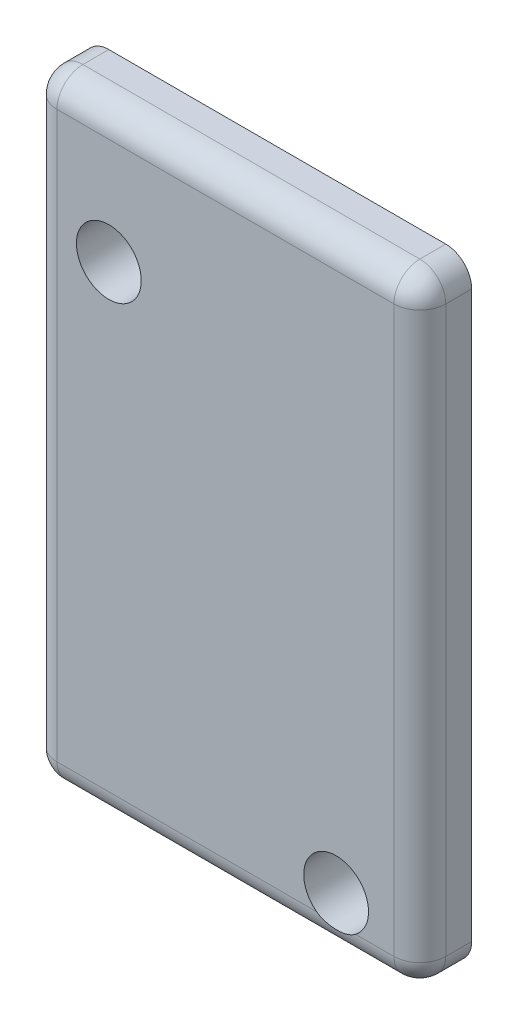
ISO-10303-21;
HEADER;
FILE_DESCRIPTION(('STEP AP214'),'2;1');
FILE_NAME('part.step','',(''),(''),'','','');
FILE_SCHEMA(('AUTOMOTIVE_DESIGN { 1 0 10303 214 1 1 1 1 }'));
ENDSEC;
DATA;
#1=APPLICATION_CONTEXT('core data for automotive mechanical design processes');
#2=APPLICATION_PROTOCOL_DEFINITION('international standard','automotive_design',2000,#1);
#3=PRODUCT_CONTEXT('',#1,'mechanical');
#4=PRODUCT('Part','Part','',(#3));
#5=PRODUCT_RELATED_PRODUCT_CATEGORY('part','',(#4));
#6=PRODUCT_DEFINITION_FORMATION('','',#4);
#7=PRODUCT_DEFINITION_CONTEXT('part definition',#1,'design');
#8=PRODUCT_DEFINITION('design','',#6,#7);
#9=PRODUCT_DEFINITION_SHAPE('','',#8);
#10=(LENGTH_UNIT() NAMED_UNIT(*) SI_UNIT(.MILLI.,.METRE.));
#11=(NAMED_UNIT(*) PLANE_ANGLE_UNIT() SI_UNIT($,.RADIAN.));
#12=(NAMED_UNIT(*) SI_UNIT($,.STERADIAN.) SOLID_ANGLE_UNIT());
#13=UNCERTAINTY_MEASURE_WITH_UNIT(LENGTH_MEASURE(1.E-05),#10,'distance_accuracy_value','');
#14=(GEOMETRIC_REPRESENTATION_CONTEXT(3) GLOBAL_UNCERTAINTY_ASSIGNED_CONTEXT((#13)) GLOBAL_UNIT_ASSIGNED_CONTEXT((#10,
#11,#12)) REPRESENTATION_CONTEXT('',''));
#15=CARTESIAN_POINT('',(0.,0.,0.));
#16=DIRECTION('',(0.,0.,1.));
#17=DIRECTION('',(1.,0.,0.));
#18=AXIS2_PLACEMENT_3D('',#15,#16,#17);
#19=CARTESIAN_POINT('',(0.,0.,2.));
#20=DIRECTION('',(0.,0.,-1.));
#21=DIRECTION('',(-1.,0.,0.));
#22=AXIS2_PLACEMENT_3D('',#19,#20,#21);
#23=PLANE('',#22);
#24=CARTESIAN_POINT('',(-3.23,-21.8,2.));
#25=DIRECTION('',(0.,0.,1.));
#26=DIRECTION('',(1.,0.,0.));
#27=AXIS2_PLACEMENT_3D('',#24,#25,#26);
#28=CIRCLE('',#27,1.25);
#29=CARTESIAN_POINT('',(-2.48,-22.8,2.));
#30=VERTEX_POINT('',#29);
#31=CARTESIAN_POINT('',(-3.98,-22.8,2.));
#32=VERTEX_POINT('',#31);
#33=EDGE_CURVE('E310',#30,#32,#28,.T.);
#34=ORIENTED_EDGE('',*,*,#33,.F.);
#35=DIRECTION('',(1.,0.,0.));
#36=VECTOR('',#35,1.);
#37=CARTESIAN_POINT('',(0.,-22.8,2.));
#38=LINE('',#37,#36);
#39=CARTESIAN_POINT('',(-0.999999999999997,-22.8,2.));
#40=VERTEX_POINT('',#39);
#41=EDGE_CURVE('E191',#30,#40,#38,.T.);
#42=ORIENTED_EDGE('',*,*,#41,.T.);
#43=DIRECTION('',(0.,1.,0.));
#44=VECTOR('',#43,1.);
#45=CARTESIAN_POINT('',(-1.,0.,2.));
#46=LINE('',#45,#44);
#47=CARTESIAN_POINT('',(-1.,-1.,2.));
#48=VERTEX_POINT('',#47);
#49=EDGE_CURVE('E189',#40,#48,#46,.T.);
#50=ORIENTED_EDGE('',*,*,#49,.T.);
#51=DIRECTION('',(-1.,0.,0.));
#52=VECTOR('',#51,1.);
#53=CARTESIAN_POINT('',(0.,-1.,2.));
#54=LINE('',#53,#52);
#55=CARTESIAN_POINT('',(-14.,-1.,2.));
#56=VERTEX_POINT('',#55);
#57=EDGE_CURVE('E186',#48,#56,#54,.T.);
#58=ORIENTED_EDGE('',*,*,#57,.T.);
#59=DIRECTION('',(0.,-1.,0.));
#60=VECTOR('',#59,1.);
#61=CARTESIAN_POINT('',(-14.,0.,2.));
#62=LINE('',#61,#60);
#63=CARTESIAN_POINT('',(-14.,-22.8,2.));
#64=VERTEX_POINT('',#63);
#65=EDGE_CURVE('E182',#56,#64,#62,.T.);
#66=ORIENTED_EDGE('',*,*,#65,.T.);
#67=DIRECTION('',(1.,0.,0.));
#68=VECTOR('',#67,1.);
#69=CARTESIAN_POINT('',(0.,-22.8,2.));
#70=LINE('',#69,#68);
#71=EDGE_CURVE('E184',#64,#32,#70,.T.);
#72=ORIENTED_EDGE('',*,*,#71,.T.);
#73=EDGE_LOOP('',(#34,#42,#50,#58,#66,#72));
#74=FACE_BOUND('',#73,.T.);
#75=CARTESIAN_POINT('',(-12.,-5.1,2.));
#76=DIRECTION('',(0.,0.,1.));
#77=DIRECTION('',(1.,0.,0.));
#78=AXIS2_PLACEMENT_3D('',#75,#76,#77);
#79=CIRCLE('',#78,1.25);
#80=CARTESIAN_POINT('',(-10.75,-5.1,2.));
#81=VERTEX_POINT('',#80);
#82=EDGE_CURVE('E149',#81,#81,#79,.T.);
#83=ORIENTED_EDGE('',*,*,#82,.F.);
#84=EDGE_LOOP('',(#83));
#85=FACE_BOUND('',#84,.T.);
#86=ADVANCED_FACE('F35',(#74,#85),#23,.F.);
#87=CARTESIAN_POINT('',(0.,0.,0.));
#88=DIRECTION('',(0.,0.,-1.));
#89=DIRECTION('',(-1.,0.,0.));
#90=AXIS2_PLACEMENT_3D('',#87,#88,#89);
#91=PLANE('',#90);
#92=CARTESIAN_POINT('',(-12.,-5.1,0.));
#93=DIRECTION('',(0.,0.,1.));
#94=DIRECTION('',(1.,0.,0.));
#95=AXIS2_PLACEMENT_3D('',#92,#93,#94);
#96=CIRCLE('',#95,1.25);
#97=CARTESIAN_POINT('',(-10.75,-5.1,0.));
#98=VERTEX_POINT('',#97);
#99=EDGE_CURVE('E155',#98,#98,#96,.T.);
#100=ORIENTED_EDGE('',*,*,#99,.T.);
#101=EDGE_LOOP('',(#100));
#102=FACE_BOUND('',#101,.T.);
#103=DIRECTION('',(0.,1.,0.));
#104=VECTOR('',#103,1.);
#105=CARTESIAN_POINT('',(0.,0.,0.));
#106=LINE('',#105,#104);
#107=CARTESIAN_POINT('',(0.,-22.8,0.));
#108=VERTEX_POINT('',#107);
#109=CARTESIAN_POINT('',(0.,-1.,0.));
#110=VERTEX_POINT('',#109);
#111=EDGE_CURVE('E125',#108,#110,#106,.T.);
#112=ORIENTED_EDGE('',*,*,#111,.F.);
#113=CARTESIAN_POINT('',(-0.999999999999997,-22.8,0.));
#114=DIRECTION('',(0.,0.,-1.));
#115=DIRECTION('',(-1.,0.,0.));
#116=AXIS2_PLACEMENT_3D('',#113,#114,#115);
#117=CIRCLE('',#116,1.);
#118=CARTESIAN_POINT('',(-0.999999999999997,-23.8,0.));
#119=VERTEX_POINT('',#118);
#120=EDGE_CURVE('E135',#108,#119,#117,.T.);
#121=ORIENTED_EDGE('',*,*,#120,.T.);
#122=DIRECTION('',(1.,0.,0.));
#123=VECTOR('',#122,1.);
#124=CARTESIAN_POINT('',(0.,-23.8,0.));
#125=LINE('',#124,#123);
#126=CARTESIAN_POINT('',(-14.,-23.8,0.));
#127=VERTEX_POINT('',#126);
#128=EDGE_CURVE('E161',#127,#119,#125,.T.);
#129=ORIENTED_EDGE('',*,*,#128,.F.);
#130=CARTESIAN_POINT('',(-14.,-22.8,0.));
#131=DIRECTION('',(0.,0.,-1.));
#132=DIRECTION('',(-1.,0.,0.));
#133=AXIS2_PLACEMENT_3D('',#130,#131,#132);
#134=CIRCLE('',#133,1.);
#135=CARTESIAN_POINT('',(-15.,-22.8,0.));
#136=VERTEX_POINT('',#135);
#137=EDGE_CURVE('E131',#127,#136,#134,.T.);
#138=ORIENTED_EDGE('',*,*,#137,.T.);
#139=DIRECTION('',(0.,-1.,0.));
#140=VECTOR('',#139,1.);
#141=CARTESIAN_POINT('',(-15.,0.,0.));
#142=LINE('',#141,#140);
#143=CARTESIAN_POINT('',(-15.,-1.,0.));
#144=VERTEX_POINT('',#143);
#145=EDGE_CURVE('E152',#144,#136,#142,.T.);
#146=ORIENTED_EDGE('',*,*,#145,.F.);
#147=CARTESIAN_POINT('',(-14.,-1.,0.));
#148=DIRECTION('',(0.,0.,-1.));
#149=DIRECTION('',(-1.,0.,0.));
#150=AXIS2_PLACEMENT_3D('',#147,#148,#149);
#151=CIRCLE('',#150,1.);
#152=CARTESIAN_POINT('',(-14.,0.,0.));
#153=VERTEX_POINT('',#152);
#154=EDGE_CURVE('E165',#144,#153,#151,.T.);
#155=ORIENTED_EDGE('',*,*,#154,.T.);
#156=DIRECTION('',(-1.,0.,0.));
#157=VECTOR('',#156,1.);
#158=CARTESIAN_POINT('',(0.,0.,0.));
#159=LINE('',#158,#157);
#160=CARTESIAN_POINT('',(-1.,0.,0.));
#161=VERTEX_POINT('',#160);
#162=EDGE_CURVE('E148',#161,#153,#159,.T.);
#163=ORIENTED_EDGE('',*,*,#162,.F.);
#164=CARTESIAN_POINT('',(-1.,-1.,0.));
#165=DIRECTION('',(0.,0.,-1.));
#166=DIRECTION('',(-1.,0.,0.));
#167=AXIS2_PLACEMENT_3D('',#164,#165,#166);
#168=CIRCLE('',#167,1.);
#169=EDGE_CURVE('E142',#161,#110,#168,.T.);
#170=ORIENTED_EDGE('',*,*,#169,.T.);
#171=EDGE_LOOP('',(#112,#121,#129,#138,#146,#155,#163,#170));
#172=FACE_BOUND('',#171,.T.);
#173=CARTESIAN_POINT('',(-3.23,-21.8,0.));
#174=DIRECTION('',(0.,0.,1.));
#175=DIRECTION('',(1.,0.,0.));
#176=AXIS2_PLACEMENT_3D('',#173,#174,#175);
#177=CIRCLE('',#176,1.25);
#178=CARTESIAN_POINT('',(-1.98,-21.8,0.));
#179=VERTEX_POINT('',#178);
#180=EDGE_CURVE('E307',#179,#179,#177,.T.);
#181=ORIENTED_EDGE('',*,*,#180,.T.);
#182=EDGE_LOOP('',(#181));
#183=FACE_BOUND('',#182,.T.);
#184=ADVANCED_FACE('F144',(#102,#172,#183),#91,.T.);
#185=CARTESIAN_POINT('',(0.,0.,2.));
#186=DIRECTION('',(-1.,0.,0.));
#187=DIRECTION('',(0.,-1.,0.));
#188=AXIS2_PLACEMENT_3D('',#185,#186,#187);
#189=PLANE('',#188);
#190=DIRECTION('',(0.,0.,-1.));
#191=VECTOR('',#190,1.);
#192=CARTESIAN_POINT('',(0.,-1.,2.));
#193=LINE('',#192,#191);
#194=CARTESIAN_POINT('',(0.,-1.,1.));
#195=VERTEX_POINT('',#194);
#196=EDGE_CURVE('E132',#110,#195,#193,.F.);
#197=ORIENTED_EDGE('',*,*,#196,.T.);
#198=DIRECTION('',(0.,1.,0.));
#199=VECTOR('',#198,1.);
#200=CARTESIAN_POINT('',(0.,0.,1.));
#201=LINE('',#200,#199);
#202=CARTESIAN_POINT('',(0.,-22.8,1.));
#203=VERTEX_POINT('',#202);
#204=EDGE_CURVE('E128',#195,#203,#201,.F.);
#205=ORIENTED_EDGE('',*,*,#204,.T.);
#206=DIRECTION('',(0.,0.,-1.));
#207=VECTOR('',#206,1.);
#208=CARTESIAN_POINT('',(0.,-22.8,2.));
#209=LINE('',#208,#207);
#210=EDGE_CURVE('E120',#203,#108,#209,.T.);
#211=ORIENTED_EDGE('',*,*,#210,.T.);
#212=ORIENTED_EDGE('',*,*,#111,.T.);
#213=EDGE_LOOP('',(#197,#205,#211,#212));
#214=FACE_BOUND('',#213,.T.);
#215=ADVANCED_FACE('F123',(#214),#189,.F.);
#216=CARTESIAN_POINT('',(0.,0.,2.));
#217=DIRECTION('',(0.,-1.,0.));
#218=DIRECTION('',(1.,0.,0.));
#219=AXIS2_PLACEMENT_3D('',#216,#217,#218);
#220=PLANE('',#219);
#221=DIRECTION('',(0.,0.,-1.));
#222=VECTOR('',#221,1.);
#223=CARTESIAN_POINT('',(-14.,0.,2.));
#224=LINE('',#223,#222);
#225=CARTESIAN_POINT('',(-14.,0.,1.));
#226=VERTEX_POINT('',#225);
#227=EDGE_CURVE('E170',#153,#226,#224,.F.);
#228=ORIENTED_EDGE('',*,*,#227,.T.);
#229=DIRECTION('',(-1.,0.,0.));
#230=VECTOR('',#229,1.);
#231=CARTESIAN_POINT('',(0.,0.,1.));
#232=LINE('',#231,#230);
#233=CARTESIAN_POINT('',(-1.,0.,1.));
#234=VERTEX_POINT('',#233);
#235=EDGE_CURVE('E193',#226,#234,#232,.F.);
#236=ORIENTED_EDGE('',*,*,#235,.T.);
#237=DIRECTION('',(0.,0.,-1.));
#238=VECTOR('',#237,1.);
#239=CARTESIAN_POINT('',(-1.,0.,2.));
#240=LINE('',#239,#238);
#241=EDGE_CURVE('E173',#234,#161,#240,.T.);
#242=ORIENTED_EDGE('',*,*,#241,.T.);
#243=ORIENTED_EDGE('',*,*,#162,.T.);
#244=EDGE_LOOP('',(#228,#236,#242,#243));
#245=FACE_BOUND('',#244,.T.);
#246=ADVANCED_FACE('F246',(#245),#220,.F.);
#247=CARTESIAN_POINT('',(-15.,0.,2.));
#248=DIRECTION('',(1.,0.,0.));
#249=DIRECTION('',(0.,1.,0.));
#250=AXIS2_PLACEMENT_3D('',#247,#248,#249);
#251=PLANE('',#250);
#252=DIRECTION('',(0.,0.,-1.));
#253=VECTOR('',#252,1.);
#254=CARTESIAN_POINT('',(-15.,-22.8,2.));
#255=LINE('',#254,#253);
#256=CARTESIAN_POINT('',(-15.,-22.8,1.));
#257=VERTEX_POINT('',#256);
#258=EDGE_CURVE('E175',#136,#257,#255,.F.);
#259=ORIENTED_EDGE('',*,*,#258,.T.);
#260=DIRECTION('',(0.,-1.,0.));
#261=VECTOR('',#260,1.);
#262=CARTESIAN_POINT('',(-15.,0.,1.));
#263=LINE('',#262,#261);
#264=CARTESIAN_POINT('',(-15.,-1.,1.));
#265=VERTEX_POINT('',#264);
#266=EDGE_CURVE('E11',#257,#265,#263,.F.);
#267=ORIENTED_EDGE('',*,*,#266,.T.);
#268=DIRECTION('',(0.,0.,-1.));
#269=VECTOR('',#268,1.);
#270=CARTESIAN_POINT('',(-15.,-1.,2.));
#271=LINE('',#270,#269);
#272=EDGE_CURVE('E177',#265,#144,#271,.T.);
#273=ORIENTED_EDGE('',*,*,#272,.T.);
#274=ORIENTED_EDGE('',*,*,#145,.T.);
#275=EDGE_LOOP('',(#259,#267,#273,#274));
#276=FACE_BOUND('',#275,.T.);
#277=ADVANCED_FACE('F243',(#276),#251,.F.);
#278=CARTESIAN_POINT('',(0.,-23.8,2.));
#279=DIRECTION('',(0.,1.,0.));
#280=DIRECTION('',(-1.,0.,0.));
#281=AXIS2_PLACEMENT_3D('',#278,#279,#280);
#282=PLANE('',#281);
#283=DIRECTION('',(0.,0.,-1.));
#284=VECTOR('',#283,1.);
#285=CARTESIAN_POINT('',(-0.999999999999997,-23.8,2.));
#286=LINE('',#285,#284);
#287=CARTESIAN_POINT('',(-0.999999999999997,-23.8,1.));
#288=VERTEX_POINT('',#287);
#289=EDGE_CURVE('E137',#119,#288,#286,.F.);
#290=ORIENTED_EDGE('',*,*,#289,.T.);
#291=DIRECTION('',(1.,0.,0.));
#292=VECTOR('',#291,1.);
#293=CARTESIAN_POINT('',(0.,-23.8,1.));
#294=LINE('',#293,#292);
#295=CARTESIAN_POINT('',(-14.,-23.8,1.));
#296=VERTEX_POINT('',#295);
#297=EDGE_CURVE('E59',#288,#296,#294,.F.);
#298=ORIENTED_EDGE('',*,*,#297,.T.);
#299=DIRECTION('',(0.,0.,-1.));
#300=VECTOR('',#299,1.);
#301=CARTESIAN_POINT('',(-14.,-23.8,2.));
#302=LINE('',#301,#300);
#303=EDGE_CURVE('E141',#296,#127,#302,.T.);
#304=ORIENTED_EDGE('',*,*,#303,.T.);
#305=ORIENTED_EDGE('',*,*,#128,.T.);
#306=EDGE_LOOP('',(#290,#298,#304,#305));
#307=FACE_BOUND('',#306,.T.);
#308=ADVANCED_FACE('F240',(#307),#282,.F.);
#309=CARTESIAN_POINT('',(-12.,-5.1,2.));
#310=DIRECTION('',(0.,0.,-1.));
#311=DIRECTION('',(-1.,0.,0.));
#312=AXIS2_PLACEMENT_3D('',#309,#310,#311);
#313=CYLINDRICAL_SURFACE('',#312,1.25);
#314=ORIENTED_EDGE('',*,*,#82,.T.);
#315=EDGE_LOOP('',(#314));
#316=FACE_BOUND('',#315,.T.);
#317=ORIENTED_EDGE('',*,*,#99,.F.);
#318=EDGE_LOOP('',(#317));
#319=FACE_BOUND('',#318,.T.);
#320=ADVANCED_FACE('F238',(#316,#319),#313,.F.);
#321=CARTESIAN_POINT('',(-3.23,-21.8,2.));
#322=DIRECTION('',(0.,0.,-1.));
#323=DIRECTION('',(-1.,0.,0.));
#324=AXIS2_PLACEMENT_3D('',#321,#322,#323);
#325=CYLINDRICAL_SURFACE('',#324,1.25);
#326=ORIENTED_EDGE('',*,*,#33,.T.);
#327=CARTESIAN_POINT('',(-3.98,-22.8,2.));
#328=CARTESIAN_POINT('',(-3.95216685685772,-22.8208754193321,1.99999586398987));
#329=CARTESIAN_POINT('',(-3.92348426480646,-22.8405703669081,1.99934713750413));
#330=CARTESIAN_POINT('',(-3.86461510059685,-22.8774834745816,1.99716564495891));
#331=CARTESIAN_POINT('',(-3.83442920727403,-22.8947027391947,1.99563327467206));
#332=CARTESIAN_POINT('',(-3.74187228885698,-22.9424987589817,1.99031685157286));
#333=CARTESIAN_POINT('',(-3.67750000394349,-22.9692152519311,1.98581342821781));
#334=CARTESIAN_POINT('',(-3.54521662549237,-23.0115962359521,1.97759753443509));
#335=CARTESIAN_POINT('',(-3.47730659565258,-23.0272640286875,1.97388482795055));
#336=CARTESIAN_POINT('',(-3.33979942824658,-23.0470995886788,1.96904572896955));
#337=CARTESIAN_POINT('',(-3.2702045782966,-23.0512821540531,1.96791600874414));
#338=CARTESIAN_POINT('',(-3.131763991366,-23.0480442615429,1.96874946257098));
#339=CARTESIAN_POINT('',(-3.06291632393299,-23.0406989272705,1.97069261234645));
#340=CARTESIAN_POINT('',(-2.92740921704492,-23.0147859358695,1.97675020659622));
#341=CARTESIAN_POINT('',(-2.86075205907436,-22.9962069461847,1.98086684316016));
#342=CARTESIAN_POINT('',(-2.73961844539446,-22.9513691806528,1.98870213819813));
#343=CARTESIAN_POINT('',(-2.68466906472272,-22.9263825472822,1.99240509140681));
#344=CARTESIAN_POINT('',(-2.60538473054195,-22.8831720756812,1.99663963335268));
#345=CARTESIAN_POINT('',(-2.57949092518132,-22.8678217449452,1.99783092485857));
#346=CARTESIAN_POINT('',(-2.52885063221708,-22.8352758407344,1.99951002933292));
#347=CARTESIAN_POINT('',(-2.50410468035409,-22.8180794177946,1.99999751694803));
#348=CARTESIAN_POINT('',(-2.48,-22.8,2.));
#349=B_SPLINE_CURVE_WITH_KNOTS('',3,(#327,#328,#329,#330,#331,#332,#333,#334,#335,#336,#337,
#338,#339,#340,#341,#342,#343,#344,#345,#346,#347,#348),.UNSPECIFIED.,.F.,.F.,(4,2,2,2,2,2,2,2,
2,2,4),(0.,0.104289480114312,0.20853228655772,0.41701042322792,0.625426234311087,
0.833573386174587,1.04036973220747,1.24737504408877,1.42813829489159,1.51843817129671,
1.60877977803547),.UNSPECIFIED.);
#350=EDGE_CURVE('E200',#32,#30,#349,.T.);
#351=ORIENTED_EDGE('',*,*,#350,.T.);
#352=EDGE_LOOP('',(#326,#351));
#353=FACE_BOUND('',#352,.T.);
#354=ORIENTED_EDGE('',*,*,#180,.F.);
#355=EDGE_LOOP('',(#354));
#356=FACE_BOUND('',#355,.T.);
#357=ADVANCED_FACE('F209',(#353,#356),#325,.F.);
#358=CARTESIAN_POINT('',(-0.999999999999997,-22.8,2.));
#359=DIRECTION('',(0.,0.,-1.));
#360=DIRECTION('',(-1.,0.,0.));
#361=AXIS2_PLACEMENT_3D('',#358,#359,#360);
#362=CYLINDRICAL_SURFACE('',#361,1.);
#363=ORIENTED_EDGE('',*,*,#210,.F.);
#364=CARTESIAN_POINT('',(-0.999999999999997,-22.8,1.));
#365=DIRECTION('',(0.,0.,-1.));
#366=DIRECTION('',(-1.,0.,0.));
#367=AXIS2_PLACEMENT_3D('',#364,#365,#366);
#368=CIRCLE('',#367,1.);
#369=EDGE_CURVE('E198',#203,#288,#368,.T.);
#370=ORIENTED_EDGE('',*,*,#369,.T.);
#371=ORIENTED_EDGE('',*,*,#289,.F.);
#372=ORIENTED_EDGE('',*,*,#120,.F.);
#373=EDGE_LOOP('',(#363,#370,#371,#372));
#374=FACE_BOUND('',#373,.T.);
#375=ADVANCED_FACE('F136',(#374),#362,.T.);
#376=CARTESIAN_POINT('',(-1.,-1.,2.));
#377=DIRECTION('',(0.,0.,-1.));
#378=DIRECTION('',(-1.,0.,0.));
#379=AXIS2_PLACEMENT_3D('',#376,#377,#378);
#380=CYLINDRICAL_SURFACE('',#379,1.);
#381=ORIENTED_EDGE('',*,*,#241,.F.);
#382=CARTESIAN_POINT('',(-1.,-1.,1.));
#383=DIRECTION('',(0.,0.,-1.));
#384=DIRECTION('',(-1.,0.,0.));
#385=AXIS2_PLACEMENT_3D('',#382,#383,#384);
#386=CIRCLE('',#385,1.);
#387=EDGE_CURVE('E195',#234,#195,#386,.T.);
#388=ORIENTED_EDGE('',*,*,#387,.T.);
#389=ORIENTED_EDGE('',*,*,#196,.F.);
#390=ORIENTED_EDGE('',*,*,#169,.F.);
#391=EDGE_LOOP('',(#381,#388,#389,#390));
#392=FACE_BOUND('',#391,.T.);
#393=ADVANCED_FACE('F255',(#392),#380,.T.);
#394=CARTESIAN_POINT('',(-14.,-1.,2.));
#395=DIRECTION('',(0.,0.,-1.));
#396=DIRECTION('',(-1.,0.,0.));
#397=AXIS2_PLACEMENT_3D('',#394,#395,#396);
#398=CYLINDRICAL_SURFACE('',#397,1.);
#399=ORIENTED_EDGE('',*,*,#272,.F.);
#400=CARTESIAN_POINT('',(-14.,-1.,1.));
#401=DIRECTION('',(0.,0.,-1.));
#402=DIRECTION('',(-1.,0.,0.));
#403=AXIS2_PLACEMENT_3D('',#400,#401,#402);
#404=CIRCLE('',#403,1.);
#405=EDGE_CURVE('E179',#265,#226,#404,.T.);
#406=ORIENTED_EDGE('',*,*,#405,.T.);
#407=ORIENTED_EDGE('',*,*,#227,.F.);
#408=ORIENTED_EDGE('',*,*,#154,.F.);
#409=EDGE_LOOP('',(#399,#406,#407,#408));
#410=FACE_BOUND('',#409,.T.);
#411=ADVANCED_FACE('F258',(#410),#398,.T.);
#412=CARTESIAN_POINT('',(-14.,-22.8,2.));
#413=DIRECTION('',(0.,0.,-1.));
#414=DIRECTION('',(-1.,0.,0.));
#415=AXIS2_PLACEMENT_3D('',#412,#413,#414);
#416=CYLINDRICAL_SURFACE('',#415,1.);
#417=ORIENTED_EDGE('',*,*,#303,.F.);
#418=CARTESIAN_POINT('',(-14.,-22.8,1.));
#419=DIRECTION('',(0.,0.,-1.));
#420=DIRECTION('',(-1.,0.,0.));
#421=AXIS2_PLACEMENT_3D('',#418,#419,#420);
#422=CIRCLE('',#421,1.);
#423=EDGE_CURVE('E44',#296,#257,#422,.T.);
#424=ORIENTED_EDGE('',*,*,#423,.T.);
#425=ORIENTED_EDGE('',*,*,#258,.F.);
#426=ORIENTED_EDGE('',*,*,#137,.F.);
#427=EDGE_LOOP('',(#417,#424,#425,#426));
#428=FACE_BOUND('',#427,.T.);
#429=ADVANCED_FACE('F225',(#428),#416,.T.);
#430=CARTESIAN_POINT('',(-0.999999999999997,-22.8,1.));
#431=DIRECTION('',(0.,0.,-1.));
#432=DIRECTION('',(-1.,0.,0.));
#433=AXIS2_PLACEMENT_3D('',#430,#431,#432);
#434=SPHERICAL_SURFACE('',#433,1.);
#435=CARTESIAN_POINT('',(-0.999999999999997,-22.8,1.));
#436=DIRECTION('',(-1.,0.,0.));
#437=DIRECTION('',(0.,-1.,0.));
#438=AXIS2_PLACEMENT_3D('',#435,#436,#437);
#439=CIRCLE('',#438,1.);
#440=EDGE_CURVE('E302',#288,#40,#439,.T.);
#441=ORIENTED_EDGE('',*,*,#440,.F.);
#442=ORIENTED_EDGE('',*,*,#369,.F.);
#443=CARTESIAN_POINT('',(-0.999999999999997,-22.8,1.));
#444=DIRECTION('',(0.,1.,0.));
#445=DIRECTION('',(0.,0.,1.));
#446=AXIS2_PLACEMENT_3D('',#443,#444,#445);
#447=CIRCLE('',#446,1.);
#448=EDGE_CURVE('E39',#40,#203,#447,.T.);
#449=ORIENTED_EDGE('',*,*,#448,.F.);
#450=EDGE_LOOP('',(#441,#442,#449));
#451=FACE_BOUND('',#450,.T.);
#452=ADVANCED_FACE('F37',(#451),#434,.T.);
#453=CARTESIAN_POINT('',(-1.,0.,1.));
#454=DIRECTION('',(0.,1.,0.));
#455=DIRECTION('',(-1.,0.,0.));
#456=AXIS2_PLACEMENT_3D('',#453,#454,#455);
#457=CYLINDRICAL_SURFACE('',#456,1.);
#458=ORIENTED_EDGE('',*,*,#448,.T.);
#459=ORIENTED_EDGE('',*,*,#204,.F.);
#460=CARTESIAN_POINT('',(-1.,-1.,1.));
#461=DIRECTION('',(0.,1.,0.));
#462=DIRECTION('',(-1.,0.,0.));
#463=AXIS2_PLACEMENT_3D('',#460,#461,#462);
#464=CIRCLE('',#463,1.);
#465=EDGE_CURVE('E300',#48,#195,#464,.T.);
#466=ORIENTED_EDGE('',*,*,#465,.F.);
#467=ORIENTED_EDGE('',*,*,#49,.F.);
#468=EDGE_LOOP('',(#458,#459,#466,#467));
#469=FACE_BOUND('',#468,.T.);
#470=ADVANCED_FACE('F217',(#469),#457,.T.);
#471=CARTESIAN_POINT('',(0.,-22.8,1.));
#472=DIRECTION('',(1.,0.,0.));
#473=DIRECTION('',(0.,1.,0.));
#474=AXIS2_PLACEMENT_3D('',#471,#472,#473);
#475=CYLINDRICAL_SURFACE('',#474,1.);
#476=ORIENTED_EDGE('',*,*,#350,.F.);
#477=ORIENTED_EDGE('',*,*,#71,.F.);
#478=CARTESIAN_POINT('',(-14.,-22.8,1.));
#479=DIRECTION('',(-1.,0.,0.));
#480=DIRECTION('',(0.,0.,1.));
#481=AXIS2_PLACEMENT_3D('',#478,#479,#480);
#482=CIRCLE('',#481,1.);
#483=EDGE_CURVE('E286',#296,#64,#482,.T.);
#484=ORIENTED_EDGE('',*,*,#483,.F.);
#485=ORIENTED_EDGE('',*,*,#297,.F.);
#486=ORIENTED_EDGE('',*,*,#440,.T.);
#487=ORIENTED_EDGE('',*,*,#41,.F.);
#488=EDGE_LOOP('',(#476,#477,#484,#485,#486,#487));
#489=FACE_BOUND('',#488,.T.);
#490=ADVANCED_FACE('F212',(#489),#475,.T.);
#491=CARTESIAN_POINT('',(-1.,-1.,1.));
#492=DIRECTION('',(0.,0.,-1.));
#493=DIRECTION('',(-1.,0.,0.));
#494=AXIS2_PLACEMENT_3D('',#491,#492,#493);
#495=SPHERICAL_SURFACE('',#494,1.);
#496=ORIENTED_EDGE('',*,*,#465,.T.);
#497=ORIENTED_EDGE('',*,*,#387,.F.);
#498=CARTESIAN_POINT('',(-1.,-1.,1.));
#499=DIRECTION('',(-1.,0.,0.));
#500=DIRECTION('',(0.,-1.,0.));
#501=AXIS2_PLACEMENT_3D('',#498,#499,#500);
#502=CIRCLE('',#501,1.);
#503=EDGE_CURVE('E296',#48,#234,#502,.T.);
#504=ORIENTED_EDGE('',*,*,#503,.F.);
#505=EDGE_LOOP('',(#496,#497,#504));
#506=FACE_BOUND('',#505,.T.);
#507=ADVANCED_FACE('F216',(#506),#495,.T.);
#508=CARTESIAN_POINT('',(-14.,-22.8,1.));
#509=DIRECTION('',(0.,0.,-1.));
#510=DIRECTION('',(-1.,0.,0.));
#511=AXIS2_PLACEMENT_3D('',#508,#509,#510);
#512=SPHERICAL_SURFACE('',#511,1.);
#513=ORIENTED_EDGE('',*,*,#423,.F.);
#514=ORIENTED_EDGE('',*,*,#483,.T.);
#515=CARTESIAN_POINT('',(-14.,-22.8,1.));
#516=DIRECTION('',(0.,1.,0.));
#517=DIRECTION('',(0.,0.,1.));
#518=AXIS2_PLACEMENT_3D('',#515,#516,#517);
#519=CIRCLE('',#518,1.);
#520=EDGE_CURVE('E288',#257,#64,#519,.T.);
#521=ORIENTED_EDGE('',*,*,#520,.F.);
#522=EDGE_LOOP('',(#513,#514,#521));
#523=FACE_BOUND('',#522,.T.);
#524=ADVANCED_FACE('F275',(#523),#512,.T.);
#525=CARTESIAN_POINT('',(0.,-1.,1.));
#526=DIRECTION('',(-1.,0.,0.));
#527=DIRECTION('',(0.,-1.,0.));
#528=AXIS2_PLACEMENT_3D('',#525,#526,#527);
#529=CYLINDRICAL_SURFACE('',#528,1.);
#530=ORIENTED_EDGE('',*,*,#503,.T.);
#531=ORIENTED_EDGE('',*,*,#235,.F.);
#532=CARTESIAN_POINT('',(-14.,-1.,1.));
#533=DIRECTION('',(-1.,0.,0.));
#534=DIRECTION('',(0.,0.,1.));
#535=AXIS2_PLACEMENT_3D('',#532,#533,#534);
#536=CIRCLE('',#535,1.);
#537=EDGE_CURVE('E293',#56,#226,#536,.T.);
#538=ORIENTED_EDGE('',*,*,#537,.F.);
#539=ORIENTED_EDGE('',*,*,#57,.F.);
#540=EDGE_LOOP('',(#530,#531,#538,#539));
#541=FACE_BOUND('',#540,.T.);
#542=ADVANCED_FACE('F272',(#541),#529,.T.);
#543=CARTESIAN_POINT('',(-14.,0.,1.));
#544=DIRECTION('',(0.,-1.,0.));
#545=DIRECTION('',(1.,0.,0.));
#546=AXIS2_PLACEMENT_3D('',#543,#544,#545);
#547=CYLINDRICAL_SURFACE('',#546,1.);
#548=ORIENTED_EDGE('',*,*,#520,.T.);
#549=ORIENTED_EDGE('',*,*,#65,.F.);
#550=CARTESIAN_POINT('',(-14.,-1.,1.));
#551=DIRECTION('',(0.,1.,0.));
#552=DIRECTION('',(-1.,0.,0.));
#553=AXIS2_PLACEMENT_3D('',#550,#551,#552);
#554=CIRCLE('',#553,1.);
#555=EDGE_CURVE('E291',#265,#56,#554,.T.);
#556=ORIENTED_EDGE('',*,*,#555,.F.);
#557=ORIENTED_EDGE('',*,*,#266,.F.);
#558=EDGE_LOOP('',(#548,#549,#556,#557));
#559=FACE_BOUND('',#558,.T.);
#560=ADVANCED_FACE('F268',(#559),#547,.T.);
#561=CARTESIAN_POINT('',(-14.,-1.,1.));
#562=DIRECTION('',(0.,0.,-1.));
#563=DIRECTION('',(-1.,0.,0.));
#564=AXIS2_PLACEMENT_3D('',#561,#562,#563);
#565=SPHERICAL_SURFACE('',#564,1.);
#566=ORIENTED_EDGE('',*,*,#537,.T.);
#567=ORIENTED_EDGE('',*,*,#405,.F.);
#568=ORIENTED_EDGE('',*,*,#555,.T.);
#569=EDGE_LOOP('',(#566,#567,#568));
#570=FACE_BOUND('',#569,.T.);
#571=ADVANCED_FACE('F265',(#570),#565,.T.);
#572=CLOSED_SHELL('',(#86,#184,#215,#246,#277,#308,#320,#357,#375,#393,#411,#429,#452,#470,#490,
#507,#524,#542,#560,#571));
#573=MANIFOLD_SOLID_BREP('B2',#572);
#574=ADVANCED_BREP_SHAPE_REPRESENTATION('',(#18,#573),#14);
#575=SHAPE_DEFINITION_REPRESENTATION(#9,#574);
ENDSEC;
END-ISO-10303-21;
